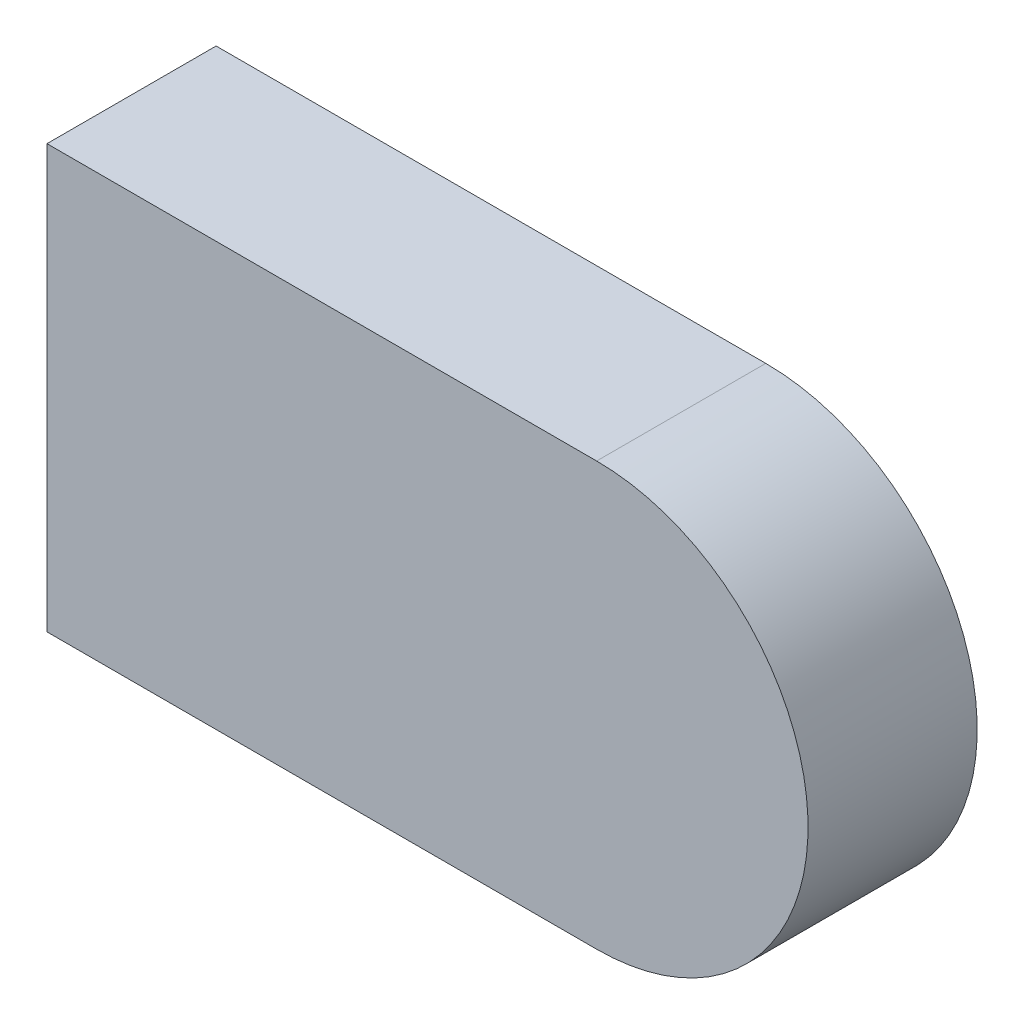
ISO-10303-21;
HEADER;
FILE_DESCRIPTION(('STEP AP214'),'2;1');
FILE_NAME('part.step','',(''),(''),'','','');
FILE_SCHEMA(('AUTOMOTIVE_DESIGN { 1 0 10303 214 1 1 1 1 }'));
ENDSEC;
DATA;
#1=APPLICATION_CONTEXT('core data for automotive mechanical design processes');
#2=APPLICATION_PROTOCOL_DEFINITION('international standard','automotive_design',2000,#1);
#3=PRODUCT_CONTEXT('',#1,'mechanical');
#4=PRODUCT('Part','Part','',(#3));
#5=PRODUCT_RELATED_PRODUCT_CATEGORY('part','',(#4));
#6=PRODUCT_DEFINITION_FORMATION('','',#4);
#7=PRODUCT_DEFINITION_CONTEXT('part definition',#1,'design');
#8=PRODUCT_DEFINITION('design','',#6,#7);
#9=PRODUCT_DEFINITION_SHAPE('','',#8);
#10=(LENGTH_UNIT() NAMED_UNIT(*) SI_UNIT(.MILLI.,.METRE.));
#11=(NAMED_UNIT(*) PLANE_ANGLE_UNIT() SI_UNIT($,.RADIAN.));
#12=(NAMED_UNIT(*) SI_UNIT($,.STERADIAN.) SOLID_ANGLE_UNIT());
#13=UNCERTAINTY_MEASURE_WITH_UNIT(LENGTH_MEASURE(1.E-05),#10,'distance_accuracy_value','');
#14=(GEOMETRIC_REPRESENTATION_CONTEXT(3) GLOBAL_UNCERTAINTY_ASSIGNED_CONTEXT((#13)) GLOBAL_UNIT_ASSIGNED_CONTEXT((#10,
#11,#12)) REPRESENTATION_CONTEXT('',''));
#15=CARTESIAN_POINT('',(0.,0.,0.));
#16=DIRECTION('',(0.,0.,1.));
#17=DIRECTION('',(1.,0.,0.));
#18=AXIS2_PLACEMENT_3D('',#15,#16,#17);
#19=CARTESIAN_POINT('',(-2.05,-1.375,0.));
#20=DIRECTION('',(0.,1.,0.));
#21=DIRECTION('',(1.,0.,0.));
#22=AXIS2_PLACEMENT_3D('',#19,#20,#21);
#23=PLANE('',#22);
#24=DIRECTION('',(1.,0.,0.));
#25=VECTOR('',#24,1.);
#26=CARTESIAN_POINT('',(-2.05,-1.375,0.));
#27=LINE('',#26,#25);
#28=CARTESIAN_POINT('',(-2.05,-1.375,0.));
#29=VERTEX_POINT('',#28);
#30=CARTESIAN_POINT('',(-1.725,-1.375,0.));
#31=VERTEX_POINT('',#30);
#32=EDGE_CURVE('E11',#29,#31,#27,.T.);
#33=ORIENTED_EDGE('',*,*,#32,.T.);
#34=DIRECTION('',(0.,0.,1.));
#35=VECTOR('',#34,1.);
#36=CARTESIAN_POINT('',(-1.725,-1.375,0.));
#37=LINE('',#36,#35);
#38=CARTESIAN_POINT('',(-1.725,-1.375,0.1));
#39=VERTEX_POINT('',#38);
#40=EDGE_CURVE('E24',#31,#39,#37,.T.);
#41=ORIENTED_EDGE('',*,*,#40,.T.);
#42=DIRECTION('',(1.,0.,0.));
#43=VECTOR('',#42,1.);
#44=CARTESIAN_POINT('',(-2.05,-1.375,0.1));
#45=LINE('',#44,#43);
#46=CARTESIAN_POINT('',(-2.05,-1.375,0.1));
#47=VERTEX_POINT('',#46);
#48=EDGE_CURVE('E88',#47,#39,#45,.T.);
#49=ORIENTED_EDGE('',*,*,#48,.F.);
#50=DIRECTION('',(0.,0.,1.));
#51=VECTOR('',#50,1.);
#52=CARTESIAN_POINT('',(-2.05,-1.375,0.));
#53=LINE('',#52,#51);
#54=EDGE_CURVE('E36',#29,#47,#53,.T.);
#55=ORIENTED_EDGE('',*,*,#54,.F.);
#56=EDGE_LOOP('',(#33,#41,#49,#55));
#57=FACE_BOUND('',#56,.T.);
#58=ADVANCED_FACE('F17',(#57),#23,.F.);
#59=CARTESIAN_POINT('',(-1.725,-1.25,0.));
#60=DIRECTION('',(0.,0.,-1.));
#61=DIRECTION('',(1.,0.,0.));
#62=AXIS2_PLACEMENT_3D('',#59,#60,#61);
#63=CYLINDRICAL_SURFACE('',#62,0.125);
#64=CARTESIAN_POINT('',(-1.725,-1.25,0.));
#65=DIRECTION('',(0.,0.,1.));
#66=DIRECTION('',(1.,0.,0.));
#67=AXIS2_PLACEMENT_3D('',#64,#65,#66);
#68=CIRCLE('',#67,0.125);
#69=CARTESIAN_POINT('',(-1.725,-1.125,0.));
#70=VERTEX_POINT('',#69);
#71=EDGE_CURVE('E85',#31,#70,#68,.T.);
#72=ORIENTED_EDGE('',*,*,#71,.T.);
#73=DIRECTION('',(0.,0.,1.));
#74=VECTOR('',#73,1.);
#75=CARTESIAN_POINT('',(-1.725,-1.125,0.));
#76=LINE('',#75,#74);
#77=CARTESIAN_POINT('',(-1.725,-1.125,0.1));
#78=VERTEX_POINT('',#77);
#79=EDGE_CURVE('E73',#70,#78,#76,.T.);
#80=ORIENTED_EDGE('',*,*,#79,.T.);
#81=CARTESIAN_POINT('',(-1.725,-1.25,0.1));
#82=DIRECTION('',(0.,0.,1.));
#83=DIRECTION('',(1.,0.,0.));
#84=AXIS2_PLACEMENT_3D('',#81,#82,#83);
#85=CIRCLE('',#84,0.125);
#86=EDGE_CURVE('E66',#39,#78,#85,.T.);
#87=ORIENTED_EDGE('',*,*,#86,.F.);
#88=ORIENTED_EDGE('',*,*,#40,.F.);
#89=EDGE_LOOP('',(#72,#80,#87,#88));
#90=FACE_BOUND('',#89,.T.);
#91=ADVANCED_FACE('F89',(#90),#63,.T.);
#92=CARTESIAN_POINT('',(-2.05,-1.125,0.));
#93=DIRECTION('',(0.,1.,0.));
#94=DIRECTION('',(1.,0.,0.));
#95=AXIS2_PLACEMENT_3D('',#92,#93,#94);
#96=PLANE('',#95);
#97=DIRECTION('',(0.,0.,1.));
#98=VECTOR('',#97,1.);
#99=CARTESIAN_POINT('',(-2.05,-1.125,0.));
#100=LINE('',#99,#98);
#101=CARTESIAN_POINT('',(-2.05,-1.125,0.));
#102=VERTEX_POINT('',#101);
#103=CARTESIAN_POINT('',(-2.05,-1.125,0.1));
#104=VERTEX_POINT('',#103);
#105=EDGE_CURVE('E56',#102,#104,#100,.T.);
#106=ORIENTED_EDGE('',*,*,#105,.T.);
#107=DIRECTION('',(1.,0.,0.));
#108=VECTOR('',#107,1.);
#109=CARTESIAN_POINT('',(-2.05,-1.125,0.1));
#110=LINE('',#109,#108);
#111=EDGE_CURVE('E67',#104,#78,#110,.T.);
#112=ORIENTED_EDGE('',*,*,#111,.T.);
#113=ORIENTED_EDGE('',*,*,#79,.F.);
#114=DIRECTION('',(1.,0.,0.));
#115=VECTOR('',#114,1.);
#116=CARTESIAN_POINT('',(-2.05,-1.125,0.));
#117=LINE('',#116,#115);
#118=EDGE_CURVE('E71',#102,#70,#117,.T.);
#119=ORIENTED_EDGE('',*,*,#118,.F.);
#120=EDGE_LOOP('',(#106,#112,#113,#119));
#121=FACE_BOUND('',#120,.T.);
#122=ADVANCED_FACE('F72',(#121),#96,.T.);
#123=CARTESIAN_POINT('',(-2.05,-1.375,0.));
#124=DIRECTION('',(-1.,0.,0.));
#125=DIRECTION('',(0.,1.,0.));
#126=AXIS2_PLACEMENT_3D('',#123,#124,#125);
#127=PLANE('',#126);
#128=ORIENTED_EDGE('',*,*,#54,.T.);
#129=DIRECTION('',(0.,1.,0.));
#130=VECTOR('',#129,1.);
#131=CARTESIAN_POINT('',(-2.05,-1.375,0.1));
#132=LINE('',#131,#130);
#133=EDGE_CURVE('E62',#47,#104,#132,.T.);
#134=ORIENTED_EDGE('',*,*,#133,.T.);
#135=ORIENTED_EDGE('',*,*,#105,.F.);
#136=DIRECTION('',(0.,1.,0.));
#137=VECTOR('',#136,1.);
#138=CARTESIAN_POINT('',(-2.05,-1.375,0.));
#139=LINE('',#138,#137);
#140=EDGE_CURVE('E60',#29,#102,#139,.T.);
#141=ORIENTED_EDGE('',*,*,#140,.F.);
#142=EDGE_LOOP('',(#128,#134,#135,#141));
#143=FACE_BOUND('',#142,.T.);
#144=ADVANCED_FACE('F58',(#143),#127,.T.);
#145=CARTESIAN_POINT('',(-1.850342514613,-1.25,0.));
#146=DIRECTION('',(0.,0.,1.));
#147=DIRECTION('',(1.,0.,0.));
#148=AXIS2_PLACEMENT_3D('',#145,#146,#147);
#149=PLANE('',#148);
#150=ORIENTED_EDGE('',*,*,#140,.T.);
#151=ORIENTED_EDGE('',*,*,#118,.T.);
#152=ORIENTED_EDGE('',*,*,#71,.F.);
#153=ORIENTED_EDGE('',*,*,#32,.F.);
#154=EDGE_LOOP('',(#150,#151,#152,#153));
#155=FACE_BOUND('',#154,.T.);
#156=ADVANCED_FACE('F77',(#155),#149,.F.);
#157=CARTESIAN_POINT('',(-1.850342514613,-1.25,0.1));
#158=DIRECTION('',(0.,0.,1.));
#159=DIRECTION('',(1.,0.,0.));
#160=AXIS2_PLACEMENT_3D('',#157,#158,#159);
#161=PLANE('',#160);
#162=ORIENTED_EDGE('',*,*,#48,.T.);
#163=ORIENTED_EDGE('',*,*,#86,.T.);
#164=ORIENTED_EDGE('',*,*,#111,.F.);
#165=ORIENTED_EDGE('',*,*,#133,.F.);
#166=EDGE_LOOP('',(#162,#163,#164,#165));
#167=FACE_BOUND('',#166,.T.);
#168=ADVANCED_FACE('F91',(#167),#161,.T.);
#169=CLOSED_SHELL('',(#58,#91,#122,#144,#156,#168));
#170=MANIFOLD_SOLID_BREP('B1',#169);
#171=ADVANCED_BREP_SHAPE_REPRESENTATION('',(#18,#170),#14);
#172=SHAPE_DEFINITION_REPRESENTATION(#9,#171);
ENDSEC;
END-ISO-10303-21;
